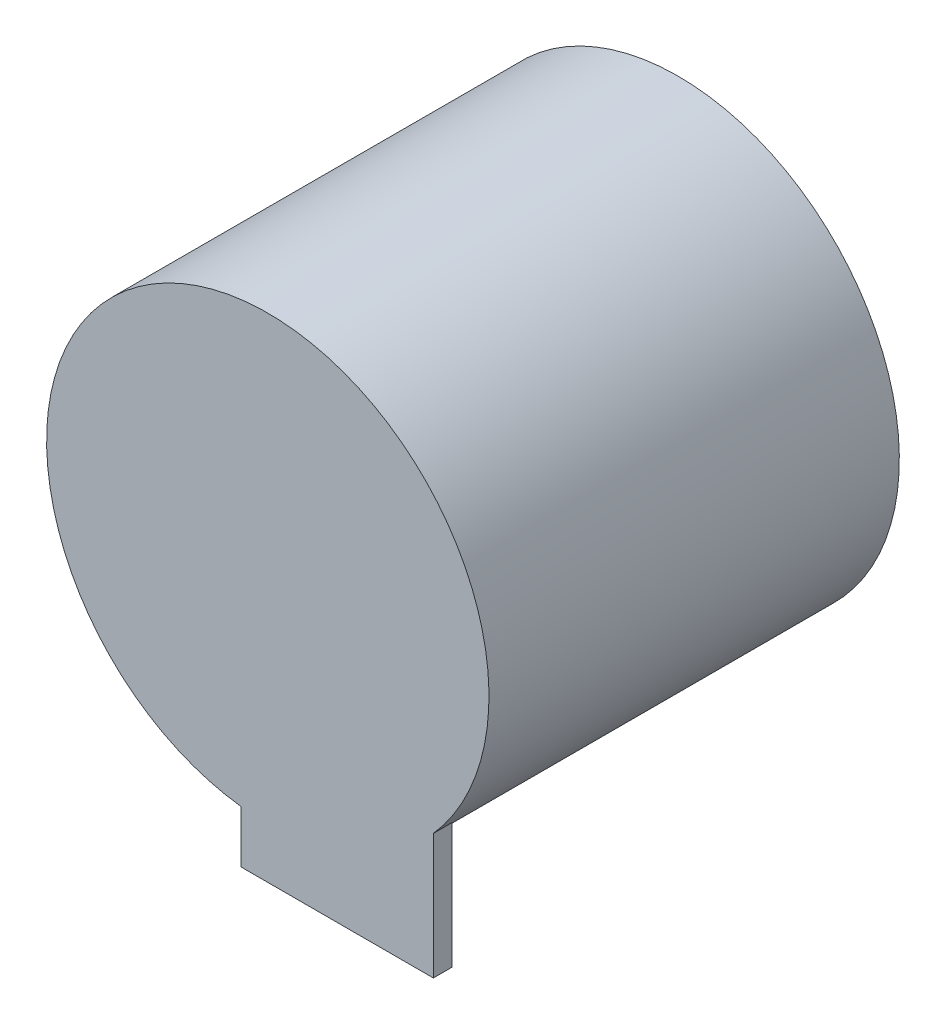
ISO-10303-21;
HEADER;
FILE_DESCRIPTION(('STEP AP214'),'2;1');
FILE_NAME('part.step','',(''),(''),'','','');
FILE_SCHEMA(('AUTOMOTIVE_DESIGN { 1 0 10303 214 1 1 1 1 }'));
ENDSEC;
DATA;
#1=APPLICATION_CONTEXT('core data for automotive mechanical design processes');
#2=APPLICATION_PROTOCOL_DEFINITION('international standard','automotive_design',2000,#1);
#3=PRODUCT_CONTEXT('',#1,'mechanical');
#4=PRODUCT('Part','Part','',(#3));
#5=PRODUCT_RELATED_PRODUCT_CATEGORY('part','',(#4));
#6=PRODUCT_DEFINITION_FORMATION('','',#4);
#7=PRODUCT_DEFINITION_CONTEXT('part definition',#1,'design');
#8=PRODUCT_DEFINITION('design','',#6,#7);
#9=PRODUCT_DEFINITION_SHAPE('','',#8);
#10=(LENGTH_UNIT() NAMED_UNIT(*) SI_UNIT(.MILLI.,.METRE.));
#11=(NAMED_UNIT(*) PLANE_ANGLE_UNIT() SI_UNIT($,.RADIAN.));
#12=(NAMED_UNIT(*) SI_UNIT($,.STERADIAN.) SOLID_ANGLE_UNIT());
#13=UNCERTAINTY_MEASURE_WITH_UNIT(LENGTH_MEASURE(1.E-05),#10,'distance_accuracy_value','');
#14=(GEOMETRIC_REPRESENTATION_CONTEXT(3) GLOBAL_UNCERTAINTY_ASSIGNED_CONTEXT((#13)) GLOBAL_UNIT_ASSIGNED_CONTEXT((#10,
#11,#12)) REPRESENTATION_CONTEXT('',''));
#15=CARTESIAN_POINT('',(0.,0.,0.));
#16=DIRECTION('',(0.,0.,1.));
#17=DIRECTION('',(1.,0.,0.));
#18=AXIS2_PLACEMENT_3D('',#15,#16,#17);
#19=CARTESIAN_POINT('',(0.,0.,-21.8));
#20=DIRECTION('',(0.,0.,1.));
#21=DIRECTION('',(1.,0.,0.));
#22=AXIS2_PLACEMENT_3D('',#19,#20,#21);
#23=CYLINDRICAL_SURFACE('',#22,23.5);
#24=CARTESIAN_POINT('',(0.,0.,-21.8));
#25=DIRECTION('',(0.,0.,-1.));
#26=DIRECTION('',(-1.,0.,0.));
#27=AXIS2_PLACEMENT_3D('',#24,#25,#26);
#28=CIRCLE('',#27,23.5);
#29=CARTESIAN_POINT('',(-23.5,0.,-21.8));
#30=VERTEX_POINT('',#29);
#31=EDGE_CURVE('E52',#30,#30,#28,.T.);
#32=ORIENTED_EDGE('',*,*,#31,.F.);
#33=EDGE_LOOP('',(#32));
#34=FACE_BOUND('',#33,.T.);
#35=CARTESIAN_POINT('',(0.,0.,19.8));
#36=DIRECTION('',(0.,0.,1.));
#37=DIRECTION('',(1.,0.,0.));
#38=AXIS2_PLACEMENT_3D('',#35,#36,#37);
#39=CIRCLE('',#38,23.5);
#40=CARTESIAN_POINT('',(-2.82760041850022,-23.3292665095433,19.8));
#41=VERTEX_POINT('',#40);
#42=CARTESIAN_POINT('',(17.5897680947124,-15.5836471461028,19.8));
#43=VERTEX_POINT('',#42);
#44=EDGE_CURVE('E13',#41,#43,#39,.T.);
#45=ORIENTED_EDGE('',*,*,#44,.F.);
#46=DIRECTION('',(0.,0.,1.));
#47=VECTOR('',#46,1.);
#48=CARTESIAN_POINT('',(-2.82760041850022,-23.3292665095433,-21.8));
#49=LINE('',#48,#47);
#50=CARTESIAN_POINT('',(-2.82760041850022,-23.3292665095433,21.8));
#51=VERTEX_POINT('',#50);
#52=EDGE_CURVE('E88',#41,#51,#49,.T.);
#53=ORIENTED_EDGE('',*,*,#52,.T.);
#54=CARTESIAN_POINT('',(0.,0.,21.8));
#55=DIRECTION('',(0.,0.,-1.));
#56=DIRECTION('',(-1.,0.,0.));
#57=AXIS2_PLACEMENT_3D('',#54,#55,#56);
#58=CIRCLE('',#57,23.5);
#59=CARTESIAN_POINT('',(17.5897680947124,-15.5836471461028,21.8));
#60=VERTEX_POINT('',#59);
#61=EDGE_CURVE('E116',#51,#60,#58,.T.);
#62=ORIENTED_EDGE('',*,*,#61,.T.);
#63=DIRECTION('',(0.,0.,1.));
#64=VECTOR('',#63,1.);
#65=CARTESIAN_POINT('',(17.5897680947124,-15.5836471461028,-21.8));
#66=LINE('',#65,#64);
#67=EDGE_CURVE('E59',#60,#43,#66,.F.);
#68=ORIENTED_EDGE('',*,*,#67,.T.);
#69=EDGE_LOOP('',(#45,#53,#62,#68));
#70=FACE_BOUND('',#69,.T.);
#71=ADVANCED_FACE('F45',(#34,#70),#23,.T.);
#72=CARTESIAN_POINT('',(0.,0.,-21.8));
#73=DIRECTION('',(0.,0.,-1.));
#74=DIRECTION('',(-1.,0.,0.));
#75=AXIS2_PLACEMENT_3D('',#72,#73,#74);
#76=PLANE('',#75);
#77=ORIENTED_EDGE('',*,*,#31,.T.);
#78=EDGE_LOOP('',(#77));
#79=FACE_BOUND('',#78,.T.);
#80=ADVANCED_FACE('F124',(#79),#76,.T.);
#81=CARTESIAN_POINT('',(0.,0.,21.8));
#82=DIRECTION('',(0.,0.,-1.));
#83=DIRECTION('',(-1.,0.,0.));
#84=AXIS2_PLACEMENT_3D('',#81,#82,#83);
#85=PLANE('',#84);
#86=ORIENTED_EDGE('',*,*,#61,.F.);
#87=DIRECTION('',(0.,-1.,0.));
#88=VECTOR('',#87,1.);
#89=CARTESIAN_POINT('',(-2.82760041850022,-13.5749334603351,21.8));
#90=LINE('',#89,#88);
#91=CARTESIAN_POINT('',(-2.82760041850022,-28.8879593631485,21.8));
#92=VERTEX_POINT('',#91);
#93=EDGE_CURVE('E108',#51,#92,#90,.T.);
#94=ORIENTED_EDGE('',*,*,#93,.T.);
#95=DIRECTION('',(1.,0.,0.));
#96=VECTOR('',#95,1.);
#97=CARTESIAN_POINT('',(-2.82760041850022,-28.8879593631485,21.8));
#98=LINE('',#97,#96);
#99=CARTESIAN_POINT('',(17.5897680947124,-28.8879593631485,21.8));
#100=VERTEX_POINT('',#99);
#101=EDGE_CURVE('E98',#92,#100,#98,.T.);
#102=ORIENTED_EDGE('',*,*,#101,.T.);
#103=DIRECTION('',(0.,1.,0.));
#104=VECTOR('',#103,1.);
#105=CARTESIAN_POINT('',(17.5897680947124,-13.5749334603351,21.8));
#106=LINE('',#105,#104);
#107=EDGE_CURVE('E92',#100,#60,#106,.T.);
#108=ORIENTED_EDGE('',*,*,#107,.T.);
#109=EDGE_LOOP('',(#86,#94,#102,#108));
#110=FACE_BOUND('',#109,.T.);
#111=ADVANCED_FACE('F122',(#110),#85,.F.);
#112=CARTESIAN_POINT('',(-2.82760041850022,-13.5749334603351,19.8));
#113=DIRECTION('',(-1.,0.,0.));
#114=DIRECTION('',(0.,0.,1.));
#115=AXIS2_PLACEMENT_3D('',#112,#113,#114);
#116=PLANE('',#115);
#117=ORIENTED_EDGE('',*,*,#52,.F.);
#118=DIRECTION('',(0.,-1.,0.));
#119=VECTOR('',#118,1.);
#120=CARTESIAN_POINT('',(-2.82760041850022,-13.5749334603351,19.8));
#121=LINE('',#120,#119);
#122=CARTESIAN_POINT('',(-2.82760041850022,-28.8879593631485,19.8));
#123=VERTEX_POINT('',#122);
#124=EDGE_CURVE('E82',#41,#123,#121,.T.);
#125=ORIENTED_EDGE('',*,*,#124,.T.);
#126=DIRECTION('',(0.,0.,1.));
#127=VECTOR('',#126,1.);
#128=CARTESIAN_POINT('',(-2.82760041850022,-28.8879593631485,19.8));
#129=LINE('',#128,#127);
#130=EDGE_CURVE('E86',#123,#92,#129,.T.);
#131=ORIENTED_EDGE('',*,*,#130,.T.);
#132=ORIENTED_EDGE('',*,*,#93,.F.);
#133=EDGE_LOOP('',(#117,#125,#131,#132));
#134=FACE_BOUND('',#133,.T.);
#135=ADVANCED_FACE('F84',(#134),#116,.T.);
#136=CARTESIAN_POINT('',(17.5897680947124,-13.5749334603351,19.8));
#137=DIRECTION('',(1.,0.,0.));
#138=DIRECTION('',(0.,0.,-1.));
#139=AXIS2_PLACEMENT_3D('',#136,#137,#138);
#140=PLANE('',#139);
#141=ORIENTED_EDGE('',*,*,#67,.F.);
#142=ORIENTED_EDGE('',*,*,#107,.F.);
#143=DIRECTION('',(0.,0.,1.));
#144=VECTOR('',#143,1.);
#145=CARTESIAN_POINT('',(17.5897680947124,-28.8879593631485,19.8));
#146=LINE('',#145,#144);
#147=CARTESIAN_POINT('',(17.5897680947124,-28.8879593631485,19.8));
#148=VERTEX_POINT('',#147);
#149=EDGE_CURVE('E99',#148,#100,#146,.T.);
#150=ORIENTED_EDGE('',*,*,#149,.F.);
#151=DIRECTION('',(0.,1.,0.));
#152=VECTOR('',#151,1.);
#153=CARTESIAN_POINT('',(17.5897680947124,-13.5749334603351,19.8));
#154=LINE('',#153,#152);
#155=EDGE_CURVE('E100',#148,#43,#154,.T.);
#156=ORIENTED_EDGE('',*,*,#155,.T.);
#157=EDGE_LOOP('',(#141,#142,#150,#156));
#158=FACE_BOUND('',#157,.T.);
#159=ADVANCED_FACE('F121',(#158),#140,.T.);
#160=CARTESIAN_POINT('',(-2.82760041850022,-28.8879593631485,19.8));
#161=DIRECTION('',(0.,-1.,0.));
#162=DIRECTION('',(0.,0.,-1.));
#163=AXIS2_PLACEMENT_3D('',#160,#161,#162);
#164=PLANE('',#163);
#165=ORIENTED_EDGE('',*,*,#101,.F.);
#166=ORIENTED_EDGE('',*,*,#130,.F.);
#167=DIRECTION('',(1.,0.,0.));
#168=VECTOR('',#167,1.);
#169=CARTESIAN_POINT('',(-2.82760041850022,-28.8879593631485,19.8));
#170=LINE('',#169,#168);
#171=EDGE_CURVE('E91',#123,#148,#170,.T.);
#172=ORIENTED_EDGE('',*,*,#171,.T.);
#173=ORIENTED_EDGE('',*,*,#149,.T.);
#174=EDGE_LOOP('',(#165,#166,#172,#173));
#175=FACE_BOUND('',#174,.T.);
#176=ADVANCED_FACE('F96',(#175),#164,.T.);
#177=CARTESIAN_POINT('',(0.,0.,19.8));
#178=DIRECTION('',(0.,0.,1.));
#179=DIRECTION('',(1.,0.,0.));
#180=AXIS2_PLACEMENT_3D('',#177,#178,#179);
#181=PLANE('',#180);
#182=ORIENTED_EDGE('',*,*,#124,.F.);
#183=ORIENTED_EDGE('',*,*,#44,.T.);
#184=ORIENTED_EDGE('',*,*,#155,.F.);
#185=ORIENTED_EDGE('',*,*,#171,.F.);
#186=EDGE_LOOP('',(#182,#183,#184,#185));
#187=FACE_BOUND('',#186,.T.);
#188=ADVANCED_FACE('F103',(#187),#181,.F.);
#189=CLOSED_SHELL('',(#71,#80,#111,#135,#159,#176,#188));
#190=MANIFOLD_SOLID_BREP('B2',#189);
#191=ADVANCED_BREP_SHAPE_REPRESENTATION('',(#18,#190),#14);
#192=SHAPE_DEFINITION_REPRESENTATION(#9,#191);
ENDSEC;
END-ISO-10303-21;
